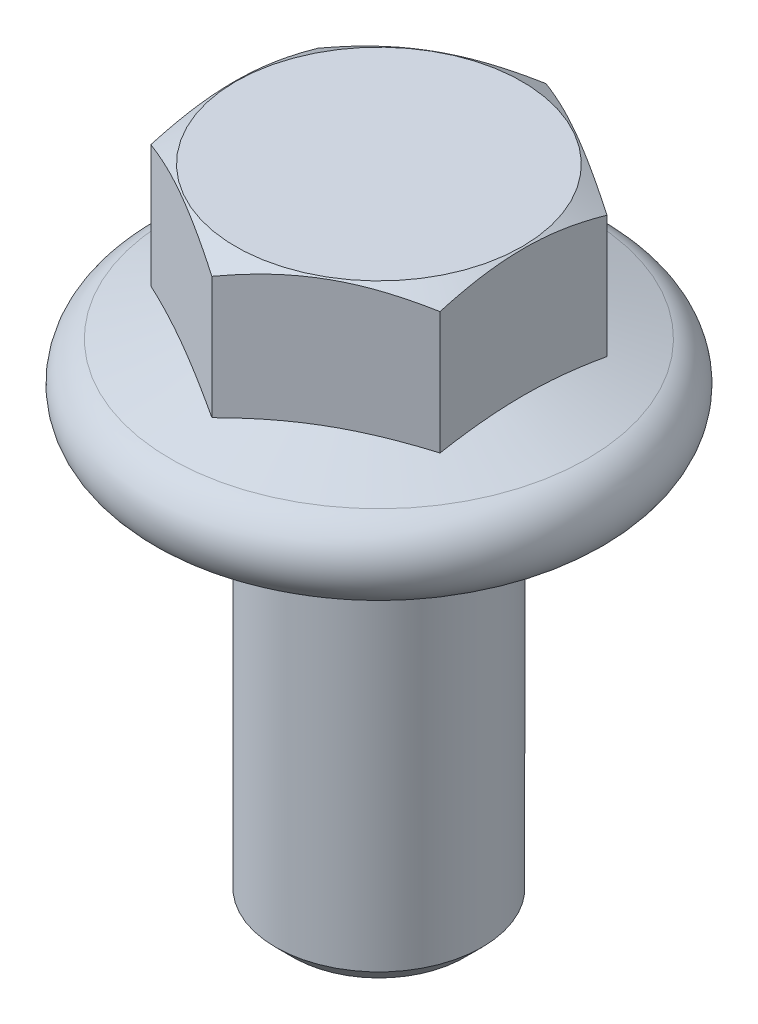
ISO-10303-21;
HEADER;
FILE_DESCRIPTION(('STEP AP214'),'2;1');
FILE_NAME('part.step','',(''),(''),'','','');
FILE_SCHEMA(('AUTOMOTIVE_DESIGN { 1 0 10303 214 1 1 1 1 }'));
ENDSEC;
DATA;
#1=APPLICATION_CONTEXT('core data for automotive mechanical design processes');
#2=APPLICATION_PROTOCOL_DEFINITION('international standard','automotive_design',2000,#1);
#3=PRODUCT_CONTEXT('',#1,'mechanical');
#4=PRODUCT('Part','Part','',(#3));
#5=PRODUCT_RELATED_PRODUCT_CATEGORY('part','',(#4));
#6=PRODUCT_DEFINITION_FORMATION('','',#4);
#7=PRODUCT_DEFINITION_CONTEXT('part definition',#1,'design');
#8=PRODUCT_DEFINITION('design','',#6,#7);
#9=PRODUCT_DEFINITION_SHAPE('','',#8);
#10=(LENGTH_UNIT() NAMED_UNIT(*) SI_UNIT(.MILLI.,.METRE.));
#11=(NAMED_UNIT(*) PLANE_ANGLE_UNIT() SI_UNIT($,.RADIAN.));
#12=(NAMED_UNIT(*) SI_UNIT($,.STERADIAN.) SOLID_ANGLE_UNIT());
#13=UNCERTAINTY_MEASURE_WITH_UNIT(LENGTH_MEASURE(1.E-05),#10,'distance_accuracy_value','');
#14=(GEOMETRIC_REPRESENTATION_CONTEXT(3) GLOBAL_UNCERTAINTY_ASSIGNED_CONTEXT((#13)) GLOBAL_UNIT_ASSIGNED_CONTEXT((#10,
#11,#12)) REPRESENTATION_CONTEXT('',''));
#15=CARTESIAN_POINT('',(0.,0.,0.));
#16=DIRECTION('',(0.,0.,1.));
#17=DIRECTION('',(1.,0.,0.));
#18=AXIS2_PLACEMENT_3D('',#15,#16,#17);
#19=CARTESIAN_POINT('',(170.6193906262,302.387780121987,22.6340859965214));
#20=DIRECTION('',(-0.5,0.,0.866025403784439));
#21=DIRECTION('',(-0.866025403784439,0.,-0.5));
#22=AXIS2_PLACEMENT_3D('',#19,#20,#21);
#23=PLANE('',#22);
#24=CARTESIAN_POINT('',(172.3693906262,301.3916498064,23.6444489676032));
#25=CARTESIAN_POINT('',(172.224447909406,301.42211784189,23.5607662510451));
#26=CARTESIAN_POINT('',(172.079027263864,301.449833689514,23.4768076021957));
#27=CARTESIAN_POINT('',(171.78724052237,301.498595308074,23.308344448448));
#28=CARTESIAN_POINT('',(171.640873777568,301.519635860691,23.2238395689367));
#29=CARTESIAN_POINT('',(171.348819013108,301.55366830598,23.0552216720571));
#30=CARTESIAN_POINT('',(171.203137661927,301.5667344217,22.9711125047369));
#31=CARTESIAN_POINT('',(170.911434317047,301.584259743163,22.8026975000469));
#32=CARTESIAN_POINT('',(170.765412471623,301.588722175582,22.7183917482842));
#33=CARTESIAN_POINT('',(170.473368780777,301.588722175582,22.5497802447587));
#34=CARTESIAN_POINT('',(170.327346935353,301.584259743163,22.4654744929959));
#35=CARTESIAN_POINT('',(170.035643590473,301.5667344217,22.2970594883059));
#36=CARTESIAN_POINT('',(169.889962239292,301.55366830598,22.2129503209857));
#37=CARTESIAN_POINT('',(169.597907474831,301.519635860691,22.0443324241061));
#38=CARTESIAN_POINT('',(169.45154073003,301.498595308074,21.9598275445948));
#39=CARTESIAN_POINT('',(169.159753988536,301.449833689514,21.7913643908471));
#40=CARTESIAN_POINT('',(169.014333342994,301.42211784189,21.7074057419977));
#41=CARTESIAN_POINT('',(168.8693906262,301.3916498064,21.6237230254396));
#42=B_SPLINE_CURVE_WITH_KNOTS('',3,(#24,#25,#26,#27,#28,#29,#30,#31,#32,#33,#34,#35,#36,#37,#38,
#39,#40,#41),.UNSPECIFIED.,.F.,.F.,(4,2,2,2,2,2,2,2,4),(0.,0.5104009483192,1.02119991788174,
1.52716902069209,2.03294833077718,2.53872764086228,3.04469674367263,3.5554957132352,
4.06589666155435),.UNSPECIFIED.);
#43=CARTESIAN_POINT('',(172.3693906262,301.3916498064,23.6444489676033));
#44=VERTEX_POINT('',#43);
#45=CARTESIAN_POINT('',(168.8693906262,301.3916498064,21.6237230254396));
#46=VERTEX_POINT('',#45);
#47=EDGE_CURVE('E41',#44,#46,#42,.T.);
#48=ORIENTED_EDGE('',*,*,#47,.F.);
#49=DIRECTION('',(0.,1.,0.));
#50=VECTOR('',#49,1.);
#51=CARTESIAN_POINT('',(172.3693906262,300.087780121987,23.6444489676033));
#52=LINE('',#51,#50);
#53=CARTESIAN_POINT('',(172.3693906262,304.354965471396,23.6444489676032));
#54=VERTEX_POINT('',#53);
#55=EDGE_CURVE('E11',#44,#54,#52,.T.);
#56=ORIENTED_EDGE('',*,*,#55,.T.);
#57=CARTESIAN_POINT('',(172.3693906262,304.354965471396,23.6444489676032));
#58=CARTESIAN_POINT('',(172.215586822965,304.406248267424,23.5556503004029));
#59=CARTESIAN_POINT('',(172.060455387488,304.45288728647,23.4660851243706));
#60=CARTESIAN_POINT('',(171.747506519499,304.534294293445,23.2854040111948));
#61=CARTESIAN_POINT('',(171.589683528302,304.569033485804,23.1942848647427));
#62=CARTESIAN_POINT('',(171.275993367122,304.62310754324,23.0131757657433));
#63=CARTESIAN_POINT('',(171.120174448871,304.642802343101,22.9232136713464));
#64=CARTESIAN_POINT('',(170.807803815391,304.666309427168,22.74286640202));
#65=CARTESIAN_POINT('',(170.651253234766,304.670141181941,22.6524818821539));
#66=CARTESIAN_POINT('',(170.358755269208,304.662149463625,22.4836081030017));
#67=CARTESIAN_POINT('',(170.222763992573,304.652288222267,22.4050935028293));
#68=CARTESIAN_POINT('',(169.951667378112,304.621040195139,22.2485757994935));
#69=CARTESIAN_POINT('',(169.816562977236,304.599642745551,22.1705732372791));
#70=CARTESIAN_POINT('',(169.544907878182,304.546153263054,22.0137330927137));
#71=CARTESIAN_POINT('',(169.408391544279,304.513834597514,21.9349153505858));
#72=CARTESIAN_POINT('',(169.137394428691,304.440484889927,21.7784550929519));
#73=CARTESIAN_POINT('',(169.002910177899,304.399471071079,21.7008105745553));
#74=CARTESIAN_POINT('',(168.8693906262,304.354965471396,21.6237230254397));
#75=B_SPLINE_CURVE_WITH_KNOTS('',3,(#57,#58,#59,#60,#61,#62,#63,#64,#65,#66,#67,#68,#69,#70,#71,
#72,#73,#74),.UNSPECIFIED.,.F.,.F.,(4,2,2,2,2,2,2,2,4),(0.,0.554778020224442,1.11088917979741,
1.65323831076759,2.19492155557116,2.66648861960575,3.1384923391401,3.62096283935506,
4.10248645365099),.UNSPECIFIED.);
#76=CARTESIAN_POINT('',(168.8693906262,304.354965471396,21.6237230254397));
#77=VERTEX_POINT('',#76);
#78=EDGE_CURVE('E33',#54,#77,#75,.T.);
#79=ORIENTED_EDGE('',*,*,#78,.T.);
#80=DIRECTION('',(0.,1.,0.));
#81=VECTOR('',#80,1.);
#82=CARTESIAN_POINT('',(168.8693906262,300.087780121987,21.6237230254396));
#83=LINE('',#82,#81);
#84=EDGE_CURVE('E148',#46,#77,#83,.T.);
#85=ORIENTED_EDGE('',*,*,#84,.F.);
#86=EDGE_LOOP('',(#48,#56,#79,#85));
#87=FACE_BOUND('',#86,.T.);
#88=ADVANCED_FACE('F17',(#87),#23,.T.);
#89=CARTESIAN_POINT('',(168.8693906262,302.387780121987,19.6029970832759));
#90=DIRECTION('',(-1.,0.,0.));
#91=DIRECTION('',(0.,0.,-1.));
#92=AXIS2_PLACEMENT_3D('',#89,#90,#91);
#93=PLANE('',#92);
#94=CARTESIAN_POINT('',(168.8693906262,301.3916498064,21.6237230254396));
#95=CARTESIAN_POINT('',(168.8693906262,301.42211784189,21.4563575923233));
#96=CARTESIAN_POINT('',(168.8693906262,301.449833689514,21.2884402946245));
#97=CARTESIAN_POINT('',(168.8693906262,301.498595308074,20.9515139871291));
#98=CARTESIAN_POINT('',(168.8693906262,301.519635860691,20.7825042281065));
#99=CARTESIAN_POINT('',(168.8693906262,301.55366830598,20.4452684343473));
#100=CARTESIAN_POINT('',(168.8693906262,301.5667344217,20.2770500997069));
#101=CARTESIAN_POINT('',(168.8693906262,301.584259743163,19.9402200903269));
#102=CARTESIAN_POINT('',(168.8693906262,301.588722175582,19.7716085868014));
#103=CARTESIAN_POINT('',(168.8693906262,301.588722175582,19.4343855797504));
#104=CARTESIAN_POINT('',(168.8693906262,301.584259743163,19.2657740762249));
#105=CARTESIAN_POINT('',(168.8693906262,301.5667344217,18.928944066845));
#106=CARTESIAN_POINT('',(168.8693906262,301.55366830598,18.7607257322046));
#107=CARTESIAN_POINT('',(168.8693906262,301.519635860691,18.4234899384454));
#108=CARTESIAN_POINT('',(168.8693906262,301.498595308074,18.2544801794228));
#109=CARTESIAN_POINT('',(168.8693906262,301.449833689514,17.9175538719273));
#110=CARTESIAN_POINT('',(168.8693906262,301.42211784189,17.7496365742286));
#111=CARTESIAN_POINT('',(168.8693906262,301.3916498064,17.5822711411123));
#112=B_SPLINE_CURVE_WITH_KNOTS('',3,(#94,#95,#96,#97,#98,#99,#100,#101,#102,#103,#104,#105,#106,
#107,#108,#109,#110,#111),.UNSPECIFIED.,.F.,.F.,(4,2,2,2,2,2,2,2,4),(0.,0.510400948319158,
1.02119991788171,1.52716902069204,2.03294833077716,2.53872764086229,3.04469674367262,
3.55549571323517,4.06589666155433),.UNSPECIFIED.);
#113=CARTESIAN_POINT('',(168.8693906262,301.3916498064,17.5822711411122));
#114=VERTEX_POINT('',#113);
#115=EDGE_CURVE('E255',#46,#114,#112,.T.);
#116=ORIENTED_EDGE('',*,*,#115,.F.);
#117=ORIENTED_EDGE('',*,*,#84,.T.);
#118=CARTESIAN_POINT('',(168.8693906262,304.354965471395,21.6237230254398));
#119=CARTESIAN_POINT('',(168.8693906262,304.406248267424,21.4461256910392));
#120=CARTESIAN_POINT('',(168.8693906262,304.45288728647,21.2669953389746));
#121=CARTESIAN_POINT('',(168.8693906262,304.534294293445,20.905633112623));
#122=CARTESIAN_POINT('',(168.8693906262,304.569033485804,20.7233948197187));
#123=CARTESIAN_POINT('',(168.8693906262,304.62310754324,20.3611766217199));
#124=CARTESIAN_POINT('',(168.8693906262,304.642802343101,20.1812524329262));
#125=CARTESIAN_POINT('',(168.8693906262,304.666309427168,19.8205578942732));
#126=CARTESIAN_POINT('',(168.8693906262,304.670141181941,19.6397888545411));
#127=CARTESIAN_POINT('',(168.8693906262,304.662149463625,19.3020412962367));
#128=CARTESIAN_POINT('',(168.8693906262,304.652288222267,19.1450120958918));
#129=CARTESIAN_POINT('',(168.8693906262,304.621040195139,18.8319766892202));
#130=CARTESIAN_POINT('',(168.8693906262,304.599642745551,18.6759715647914));
#131=CARTESIAN_POINT('',(168.8693906262,304.546153263054,18.3622912756605));
#132=CARTESIAN_POINT('',(168.8693906262,304.513834597514,18.2046557914049));
#133=CARTESIAN_POINT('',(168.8693906262,304.440484889927,17.8917352761369));
#134=CARTESIAN_POINT('',(168.8693906262,304.399471071079,17.7364462393436));
#135=CARTESIAN_POINT('',(168.8693906262,304.354965471396,17.5822711411123));
#136=B_SPLINE_CURVE_WITH_KNOTS('',3,(#118,#119,#120,#121,#122,#123,#124,#125,#126,#127,#128,
#129,#130,#131,#132,#133,#134,#135),.UNSPECIFIED.,.F.,.F.,(4,2,2,2,2,2,2,2,4),(0.,
0.554778020224522,1.11088917979753,1.65323831076773,2.19492155557132,2.66648861960593,
3.13849233914033,3.6209628393553,4.10248645365131),.UNSPECIFIED.);
#137=CARTESIAN_POINT('',(168.8693906262,304.354965471396,17.5822711411123));
#138=VERTEX_POINT('',#137);
#139=EDGE_CURVE('E150',#77,#138,#136,.T.);
#140=ORIENTED_EDGE('',*,*,#139,.T.);
#141=DIRECTION('',(0.,1.,0.));
#142=VECTOR('',#141,1.);
#143=CARTESIAN_POINT('',(168.8693906262,300.087780121987,17.5822711411122));
#144=LINE('',#143,#142);
#145=EDGE_CURVE('E159',#114,#138,#144,.T.);
#146=ORIENTED_EDGE('',*,*,#145,.F.);
#147=EDGE_LOOP('',(#116,#117,#140,#146));
#148=FACE_BOUND('',#147,.T.);
#149=ADVANCED_FACE('F260',(#148),#93,.T.);
#150=CARTESIAN_POINT('',(170.6193906262,302.387780121987,16.5719081700304));
#151=DIRECTION('',(-0.5,0.,-0.866025403784439));
#152=DIRECTION('',(0.866025403784439,0.,-0.5));
#153=AXIS2_PLACEMENT_3D('',#150,#151,#152);
#154=PLANE('',#153);
#155=CARTESIAN_POINT('',(168.8693906262,301.3916498064,17.5822711411123));
#156=CARTESIAN_POINT('',(169.014333342994,301.42211784189,17.4985884245541));
#157=CARTESIAN_POINT('',(169.159753988536,301.449833689514,17.4146297757047));
#158=CARTESIAN_POINT('',(169.45154073003,301.498595308074,17.246166621957));
#159=CARTESIAN_POINT('',(169.597907474831,301.519635860691,17.1616617424457));
#160=CARTESIAN_POINT('',(169.889962239292,301.55366830598,16.9930438455661));
#161=CARTESIAN_POINT('',(170.035643590473,301.5667344217,16.9089346782459));
#162=CARTESIAN_POINT('',(170.327346935353,301.584259743163,16.7405196735559));
#163=CARTESIAN_POINT('',(170.473368780777,301.588722175582,16.6562139217932));
#164=CARTESIAN_POINT('',(170.765412471623,301.588722175582,16.4876024182677));
#165=CARTESIAN_POINT('',(170.911434317047,301.584259743163,16.4032966665049));
#166=CARTESIAN_POINT('',(171.203137661927,301.5667344217,16.2348816618149));
#167=CARTESIAN_POINT('',(171.348819013108,301.55366830598,16.1507724944947));
#168=CARTESIAN_POINT('',(171.640873777568,301.519635860691,15.9821545976151));
#169=CARTESIAN_POINT('',(171.78724052237,301.498595308074,15.8976497181038));
#170=CARTESIAN_POINT('',(172.079027263864,301.449833689514,15.7291865643561));
#171=CARTESIAN_POINT('',(172.224447909406,301.42211784189,15.6452279155067));
#172=CARTESIAN_POINT('',(172.3693906262,301.3916498064,15.5615451989486));
#173=B_SPLINE_CURVE_WITH_KNOTS('',3,(#155,#156,#157,#158,#159,#160,#161,#162,#163,#164,#165,
#166,#167,#168,#169,#170,#171,#172),.UNSPECIFIED.,.F.,.F.,(4,2,2,2,2,2,2,2,4),(0.,
0.5104009483192,1.02119991788174,1.52716902069209,2.03294833077718,2.53872764086228,
3.04469674367263,3.55549571323517,4.06589666155434),.UNSPECIFIED.);
#174=CARTESIAN_POINT('',(172.3693906262,301.3916498064,15.5615451989486));
#175=VERTEX_POINT('',#174);
#176=EDGE_CURVE('E228',#114,#175,#173,.T.);
#177=ORIENTED_EDGE('',*,*,#176,.F.);
#178=ORIENTED_EDGE('',*,*,#145,.T.);
#179=CARTESIAN_POINT('',(168.8693906262,304.354965471396,17.5822711411122));
#180=CARTESIAN_POINT('',(169.023194429435,304.406248267424,17.4934724739119));
#181=CARTESIAN_POINT('',(169.178325864912,304.45288728647,17.4039072978796));
#182=CARTESIAN_POINT('',(169.491274732901,304.534294293445,17.2232261847038));
#183=CARTESIAN_POINT('',(169.649097724098,304.569033485804,17.1321070382517));
#184=CARTESIAN_POINT('',(169.962787885278,304.62310754324,16.9509979392523));
#185=CARTESIAN_POINT('',(170.118606803529,304.642802343101,16.8610358448554));
#186=CARTESIAN_POINT('',(170.430977437009,304.666309427168,16.680688575529));
#187=CARTESIAN_POINT('',(170.587528017634,304.670141181941,16.5903040556629));
#188=CARTESIAN_POINT('',(170.880025983192,304.662149463625,16.4214302765107));
#189=CARTESIAN_POINT('',(171.016017259827,304.652288222267,16.3429156763382));
#190=CARTESIAN_POINT('',(171.287113874288,304.621040195139,16.1863979730025));
#191=CARTESIAN_POINT('',(171.422218275164,304.599642745551,16.108395410788));
#192=CARTESIAN_POINT('',(171.693873374218,304.546153263054,15.9515552662226));
#193=CARTESIAN_POINT('',(171.830389708121,304.513834597514,15.8727375240948));
#194=CARTESIAN_POINT('',(172.101386823709,304.440484889927,15.7162772664609));
#195=CARTESIAN_POINT('',(172.235871074501,304.399471071079,15.6386327480642));
#196=CARTESIAN_POINT('',(172.3693906262,304.354965471396,15.5615451989486));
#197=B_SPLINE_CURVE_WITH_KNOTS('',3,(#179,#180,#181,#182,#183,#184,#185,#186,#187,#188,#189,
#190,#191,#192,#193,#194,#195,#196),.UNSPECIFIED.,.F.,.F.,(4,2,2,2,2,2,2,2,4),(0.,
0.554778020224465,1.11088917979744,1.65323831076765,2.19492155557118,2.66648861960576,
3.13849233914014,3.62096283935509,4.10248645365103),.UNSPECIFIED.);
#198=CARTESIAN_POINT('',(172.3693906262,304.354965471396,15.5615451989486));
#199=VERTEX_POINT('',#198);
#200=EDGE_CURVE('E158',#138,#199,#197,.T.);
#201=ORIENTED_EDGE('',*,*,#200,.T.);
#202=DIRECTION('',(0.,1.,0.));
#203=VECTOR('',#202,1.);
#204=CARTESIAN_POINT('',(172.3693906262,300.087780121987,15.5615451989486));
#205=LINE('',#204,#203);
#206=EDGE_CURVE('E156',#175,#199,#205,.T.);
#207=ORIENTED_EDGE('',*,*,#206,.F.);
#208=EDGE_LOOP('',(#177,#178,#201,#207));
#209=FACE_BOUND('',#208,.T.);
#210=ADVANCED_FACE('F219',(#209),#154,.T.);
#211=CARTESIAN_POINT('',(174.1193906262,302.387780121987,16.5719081700304));
#212=DIRECTION('',(0.5,0.,-0.866025403784439));
#213=DIRECTION('',(0.866025403784439,0.,0.5));
#214=AXIS2_PLACEMENT_3D('',#211,#212,#213);
#215=PLANE('',#214);
#216=CARTESIAN_POINT('',(172.3693906262,301.3916498064,15.5615451989486));
#217=CARTESIAN_POINT('',(172.514333342994,301.42211784189,15.6452279155068));
#218=CARTESIAN_POINT('',(172.659753988536,301.449833689514,15.7291865643561));
#219=CARTESIAN_POINT('',(172.95154073003,301.498595308074,15.8976497181038));
#220=CARTESIAN_POINT('',(173.097907474832,301.519635860691,15.9821545976151));
#221=CARTESIAN_POINT('',(173.389962239292,301.55366830598,16.1507724944947));
#222=CARTESIAN_POINT('',(173.535643590473,301.5667344217,16.2348816618149));
#223=CARTESIAN_POINT('',(173.827346935353,301.584259743163,16.4032966665049));
#224=CARTESIAN_POINT('',(173.973368780777,301.588722175582,16.4876024182676));
#225=CARTESIAN_POINT('',(174.265412471623,301.588722175582,16.6562139217932));
#226=CARTESIAN_POINT('',(174.411434317047,301.584259743163,16.7405196735559));
#227=CARTESIAN_POINT('',(174.703137661927,301.5667344217,16.9089346782459));
#228=CARTESIAN_POINT('',(174.848819013108,301.55366830598,16.9930438455661));
#229=CARTESIAN_POINT('',(175.140873777568,301.519635860691,17.1616617424457));
#230=CARTESIAN_POINT('',(175.28724052237,301.498595308074,17.246166621957));
#231=CARTESIAN_POINT('',(175.579027263864,301.449833689514,17.4146297757047));
#232=CARTESIAN_POINT('',(175.724447909406,301.42211784189,17.4985884245541));
#233=CARTESIAN_POINT('',(175.8693906262,301.3916498064,17.5822711411123));
#234=B_SPLINE_CURVE_WITH_KNOTS('',3,(#216,#217,#218,#219,#220,#221,#222,#223,#224,#225,#226,
#227,#228,#229,#230,#231,#232,#233),.UNSPECIFIED.,.F.,.F.,(4,2,2,2,2,2,2,2,4),(0.,
0.510400948319148,1.02119991788172,1.52716902069204,2.03294833077716,2.53872764086225,
3.0446967436726,3.55549571323517,4.06589666155434),.UNSPECIFIED.);
#235=CARTESIAN_POINT('',(175.8693906262,301.3916498064,17.5822711411122));
#236=VERTEX_POINT('',#235);
#237=EDGE_CURVE('E64',#175,#236,#234,.T.);
#238=ORIENTED_EDGE('',*,*,#237,.F.);
#239=ORIENTED_EDGE('',*,*,#206,.T.);
#240=CARTESIAN_POINT('',(172.3693906262,304.354965471396,15.5615451989486));
#241=CARTESIAN_POINT('',(172.523194429435,304.406248267424,15.6503438661489));
#242=CARTESIAN_POINT('',(172.678325864912,304.45288728647,15.7399090421812));
#243=CARTESIAN_POINT('',(172.991274732901,304.534294293445,15.920590155357));
#244=CARTESIAN_POINT('',(173.149097724098,304.569033485804,16.0117093018091));
#245=CARTESIAN_POINT('',(173.462787885278,304.62310754324,16.1928184008085));
#246=CARTESIAN_POINT('',(173.618606803529,304.642802343101,16.2827804952054));
#247=CARTESIAN_POINT('',(173.930977437009,304.666309427168,16.4631277645319));
#248=CARTESIAN_POINT('',(174.087528017634,304.670141181941,16.553512284398));
#249=CARTESIAN_POINT('',(174.380025983192,304.662149463625,16.7223860635501));
#250=CARTESIAN_POINT('',(174.516017259827,304.652288222267,16.8009006637226));
#251=CARTESIAN_POINT('',(174.787113874288,304.621040195139,16.9574183670583));
#252=CARTESIAN_POINT('',(174.922218275164,304.599642745551,17.0354209292727));
#253=CARTESIAN_POINT('',(175.193873374218,304.546153263054,17.1922610738382));
#254=CARTESIAN_POINT('',(175.330389708121,304.513834597514,17.271078815966));
#255=CARTESIAN_POINT('',(175.601386823709,304.440484889927,17.4275390735999));
#256=CARTESIAN_POINT('',(175.735871074501,304.399471071079,17.5051835919966));
#257=CARTESIAN_POINT('',(175.8693906262,304.354965471396,17.5822711411122));
#258=B_SPLINE_CURVE_WITH_KNOTS('',3,(#240,#241,#242,#243,#244,#245,#246,#247,#248,#249,#250,
#251,#252,#253,#254,#255,#256,#257),.UNSPECIFIED.,.F.,.F.,(4,2,2,2,2,2,2,2,4),(0.,
0.554778020224465,1.11088917979744,1.65323831076761,2.19492155557121,2.66648861960579,
3.13849233914013,3.62096283935506,4.10248645365103),.UNSPECIFIED.);
#259=CARTESIAN_POINT('',(175.8693906262,304.354965471396,17.5822711411122));
#260=VERTEX_POINT('',#259);
#261=EDGE_CURVE('E155',#199,#260,#258,.T.);
#262=ORIENTED_EDGE('',*,*,#261,.T.);
#263=DIRECTION('',(0.,1.,0.));
#264=VECTOR('',#263,1.);
#265=CARTESIAN_POINT('',(175.8693906262,300.087780121987,17.5822711411122));
#266=LINE('',#265,#264);
#267=EDGE_CURVE('E153',#236,#260,#266,.T.);
#268=ORIENTED_EDGE('',*,*,#267,.F.);
#269=EDGE_LOOP('',(#238,#239,#262,#268));
#270=FACE_BOUND('',#269,.T.);
#271=ADVANCED_FACE('F214',(#270),#215,.T.);
#272=CARTESIAN_POINT('',(175.8693906262,302.387780121987,19.6029970832759));
#273=DIRECTION('',(1.,0.,0.));
#274=DIRECTION('',(0.,0.,1.));
#275=AXIS2_PLACEMENT_3D('',#272,#273,#274);
#276=PLANE('',#275);
#277=CARTESIAN_POINT('',(175.8693906262,301.3916498064,17.5822711411122));
#278=CARTESIAN_POINT('',(175.8693906262,301.42211784189,17.7496365742285));
#279=CARTESIAN_POINT('',(175.8693906262,301.449833689514,17.9175538719273));
#280=CARTESIAN_POINT('',(175.8693906262,301.498595308074,18.2544801794228));
#281=CARTESIAN_POINT('',(175.8693906262,301.519635860691,18.4234899384453));
#282=CARTESIAN_POINT('',(175.8693906262,301.55366830598,18.7607257322045));
#283=CARTESIAN_POINT('',(175.8693906262,301.5667344217,18.9289440668449));
#284=CARTESIAN_POINT('',(175.8693906262,301.584259743163,19.2657740762249));
#285=CARTESIAN_POINT('',(175.8693906262,301.588722175582,19.4343855797504));
#286=CARTESIAN_POINT('',(175.8693906262,301.588722175582,19.7716085868014));
#287=CARTESIAN_POINT('',(175.8693906262,301.584259743163,19.9402200903269));
#288=CARTESIAN_POINT('',(175.8693906262,301.5667344217,20.2770500997069));
#289=CARTESIAN_POINT('',(175.8693906262,301.55366830598,20.4452684343473));
#290=CARTESIAN_POINT('',(175.8693906262,301.519635860691,20.7825042281065));
#291=CARTESIAN_POINT('',(175.8693906262,301.498595308074,20.951513987129));
#292=CARTESIAN_POINT('',(175.8693906262,301.449833689514,21.2884402946245));
#293=CARTESIAN_POINT('',(175.8693906262,301.42211784189,21.4563575923233));
#294=CARTESIAN_POINT('',(175.8693906262,301.3916498064,21.6237230254396));
#295=B_SPLINE_CURVE_WITH_KNOTS('',3,(#277,#278,#279,#280,#281,#282,#283,#284,#285,#286,#287,
#288,#289,#290,#291,#292,#293,#294),.UNSPECIFIED.,.F.,.F.,(4,2,2,2,2,2,2,2,4),(0.,
0.510400948319165,1.02119991788172,1.52716902069205,2.03294833077719,2.53872764086232,
3.04469674367266,3.55549571323521,4.06589666155438),.UNSPECIFIED.);
#296=CARTESIAN_POINT('',(175.8693906262,301.3916498064,21.6237230254396));
#297=VERTEX_POINT('',#296);
#298=EDGE_CURVE('E21',#236,#297,#295,.T.);
#299=ORIENTED_EDGE('',*,*,#298,.F.);
#300=ORIENTED_EDGE('',*,*,#267,.T.);
#301=CARTESIAN_POINT('',(175.8693906262,304.354965471396,17.5822711411123));
#302=CARTESIAN_POINT('',(175.8693906262,304.406248267424,17.7598684755129));
#303=CARTESIAN_POINT('',(175.8693906262,304.45288728647,17.9389988275775));
#304=CARTESIAN_POINT('',(175.8693906262,304.534294293445,18.3003610539291));
#305=CARTESIAN_POINT('',(175.8693906262,304.569033485804,18.4825993468334));
#306=CARTESIAN_POINT('',(175.8693906262,304.62310754324,18.8448175448321));
#307=CARTESIAN_POINT('',(175.8693906262,304.642802343101,19.0247417336259));
#308=CARTESIAN_POINT('',(175.8693906262,304.666309427168,19.3854362722788));
#309=CARTESIAN_POINT('',(175.8693906262,304.670141181941,19.5662053120109));
#310=CARTESIAN_POINT('',(175.8693906262,304.662149463625,19.9039528703153));
#311=CARTESIAN_POINT('',(175.8693906262,304.652288222267,20.0609820706602));
#312=CARTESIAN_POINT('',(175.8693906262,304.621040195139,20.3740174773317));
#313=CARTESIAN_POINT('',(175.8693906262,304.599642745551,20.5300226017606));
#314=CARTESIAN_POINT('',(175.8693906262,304.546153263054,20.8437028908914));
#315=CARTESIAN_POINT('',(175.8693906262,304.513834597514,21.001338375147));
#316=CARTESIAN_POINT('',(175.8693906262,304.440484889927,21.3142588904149));
#317=CARTESIAN_POINT('',(175.8693906262,304.399471071079,21.4695479272082));
#318=CARTESIAN_POINT('',(175.8693906262,304.354965471396,21.6237230254395));
#319=B_SPLINE_CURVE_WITH_KNOTS('',3,(#301,#302,#303,#304,#305,#306,#307,#308,#309,#310,#311,
#312,#313,#314,#315,#316,#317,#318),.UNSPECIFIED.,.F.,.F.,(4,2,2,2,2,2,2,2,4),(0.,
0.554778020224448,1.1108891797974,1.65323831076756,2.1949215555711,2.66648861960567,
3.13849233914003,3.62096283935496,4.10248645365089),.UNSPECIFIED.);
#320=CARTESIAN_POINT('',(175.8693906262,304.354965471396,21.6237230254395));
#321=VERTEX_POINT('',#320);
#322=EDGE_CURVE('E152',#260,#321,#319,.T.);
#323=ORIENTED_EDGE('',*,*,#322,.T.);
#324=DIRECTION('',(0.,1.,0.));
#325=VECTOR('',#324,1.);
#326=CARTESIAN_POINT('',(175.8693906262,300.087780121987,21.6237230254396));
#327=LINE('',#326,#325);
#328=EDGE_CURVE('E73',#297,#321,#327,.T.);
#329=ORIENTED_EDGE('',*,*,#328,.F.);
#330=EDGE_LOOP('',(#299,#300,#323,#329));
#331=FACE_BOUND('',#330,.T.);
#332=ADVANCED_FACE('F211',(#331),#276,.T.);
#333=CARTESIAN_POINT('',(174.1193906262,302.387780121987,22.6340859965214));
#334=DIRECTION('',(0.5,0.,0.866025403784439));
#335=DIRECTION('',(-0.866025403784439,0.,0.5));
#336=AXIS2_PLACEMENT_3D('',#333,#334,#335);
#337=PLANE('',#336);
#338=CARTESIAN_POINT('',(175.8693906262,301.3916498064,21.6237230254396));
#339=CARTESIAN_POINT('',(175.724447909406,301.42211784189,21.7074057419977));
#340=CARTESIAN_POINT('',(175.579027263864,301.449833689514,21.7913643908471));
#341=CARTESIAN_POINT('',(175.28724052237,301.498595308074,21.9598275445948));
#342=CARTESIAN_POINT('',(175.140873777568,301.519635860691,22.0443324241061));
#343=CARTESIAN_POINT('',(174.848819013108,301.55366830598,22.2129503209857));
#344=CARTESIAN_POINT('',(174.703137661927,301.5667344217,22.2970594883059));
#345=CARTESIAN_POINT('',(174.411434317047,301.584259743163,22.4654744929959));
#346=CARTESIAN_POINT('',(174.265412471623,301.588722175582,22.5497802447587));
#347=CARTESIAN_POINT('',(173.973368780777,301.588722175582,22.7183917482842));
#348=CARTESIAN_POINT('',(173.827346935353,301.584259743163,22.8026975000469));
#349=CARTESIAN_POINT('',(173.535643590473,301.5667344217,22.9711125047369));
#350=CARTESIAN_POINT('',(173.389962239292,301.55366830598,23.0552216720571));
#351=CARTESIAN_POINT('',(173.097907474832,301.519635860691,23.2238395689367));
#352=CARTESIAN_POINT('',(172.95154073003,301.498595308074,23.308344448448));
#353=CARTESIAN_POINT('',(172.659753988536,301.449833689514,23.4768076021957));
#354=CARTESIAN_POINT('',(172.514333342994,301.42211784189,23.5607662510451));
#355=CARTESIAN_POINT('',(172.3693906262,301.3916498064,23.6444489676032));
#356=B_SPLINE_CURVE_WITH_KNOTS('',3,(#338,#339,#340,#341,#342,#343,#344,#345,#346,#347,#348,
#349,#350,#351,#352,#353,#354,#355),.UNSPECIFIED.,.F.,.F.,(4,2,2,2,2,2,2,2,4),(0.,
0.510400948319148,1.02119991788172,1.52716902069207,2.03294833077716,2.53872764086225,
3.0446967436726,3.55549571323514,4.06589666155434),.UNSPECIFIED.);
#357=EDGE_CURVE('E121',#297,#44,#356,.T.);
#358=ORIENTED_EDGE('',*,*,#357,.F.);
#359=ORIENTED_EDGE('',*,*,#328,.T.);
#360=CARTESIAN_POINT('',(175.8693906262,304.354965471396,21.6237230254396));
#361=CARTESIAN_POINT('',(175.715586822965,304.406248267424,21.7125216926399));
#362=CARTESIAN_POINT('',(175.560455387488,304.45288728647,21.8020868686722));
#363=CARTESIAN_POINT('',(175.247506519499,304.534294293445,21.982767981848));
#364=CARTESIAN_POINT('',(175.089683528302,304.569033485804,22.0738871283001));
#365=CARTESIAN_POINT('',(174.775993367122,304.62310754324,22.2549962272995));
#366=CARTESIAN_POINT('',(174.620174448871,304.642802343101,22.3449583216964));
#367=CARTESIAN_POINT('',(174.307803815391,304.666309427168,22.5253055910228));
#368=CARTESIAN_POINT('',(174.151253234766,304.670141181941,22.6156901108889));
#369=CARTESIAN_POINT('',(173.858755269208,304.662149463625,22.7845638900411));
#370=CARTESIAN_POINT('',(173.722763992573,304.652288222267,22.8630784902135));
#371=CARTESIAN_POINT('',(173.451667378112,304.621040195139,23.0195961935493));
#372=CARTESIAN_POINT('',(173.316562977236,304.599642745551,23.0975987557637));
#373=CARTESIAN_POINT('',(173.044907878182,304.546153263054,23.2544389003291));
#374=CARTESIAN_POINT('',(172.908391544279,304.513834597514,23.333256642457));
#375=CARTESIAN_POINT('',(172.637394428691,304.440484889927,23.4897169000909));
#376=CARTESIAN_POINT('',(172.502910177899,304.399471071079,23.5673614184876));
#377=CARTESIAN_POINT('',(172.3693906262,304.354965471396,23.6444489676032));
#378=B_SPLINE_CURVE_WITH_KNOTS('',3,(#360,#361,#362,#363,#364,#365,#366,#367,#368,#369,#370,
#371,#372,#373,#374,#375,#376,#377),.UNSPECIFIED.,.F.,.F.,(4,2,2,2,2,2,2,2,4),(0.,
0.554778020224465,1.11088917979744,1.65323831076758,2.19492155557116,2.66648861960575,
3.13849233914013,3.62096283935509,4.10248645365103),.UNSPECIFIED.);
#379=EDGE_CURVE('E116',#321,#54,#378,.T.);
#380=ORIENTED_EDGE('',*,*,#379,.T.);
#381=ORIENTED_EDGE('',*,*,#55,.F.);
#382=EDGE_LOOP('',(#358,#359,#380,#381));
#383=FACE_BOUND('',#382,.T.);
#384=ADVANCED_FACE('F181',(#383),#337,.T.);
#385=CARTESIAN_POINT('',(172.3693906262,306.688298804729,19.6029970832759));
#386=DIRECTION('',(0.,-1.,0.));
#387=DIRECTION('',(1.,0.,0.));
#388=AXIS2_PLACEMENT_3D('',#385,#386,#387);
#389=CONICAL_SURFACE('',#388,0.,1.0471975511966);
#390=ORIENTED_EDGE('',*,*,#78,.F.);
#391=ORIENTED_EDGE('',*,*,#379,.F.);
#392=ORIENTED_EDGE('',*,*,#322,.F.);
#393=ORIENTED_EDGE('',*,*,#261,.F.);
#394=ORIENTED_EDGE('',*,*,#200,.F.);
#395=ORIENTED_EDGE('',*,*,#139,.F.);
#396=EDGE_LOOP('',(#390,#391,#392,#393,#394,#395));
#397=FACE_BOUND('',#396,.T.);
#398=CARTESIAN_POINT('',(172.3693906262,304.687780121987,19.6029970832759));
#399=DIRECTION('',(0.,1.,0.));
#400=DIRECTION('',(1.,0.,0.));
#401=AXIS2_PLACEMENT_3D('',#398,#399,#400);
#402=CIRCLE('',#401,3.465);
#403=CARTESIAN_POINT('',(175.8343906262,304.687780121987,19.6029970832759));
#404=VERTEX_POINT('',#403);
#405=EDGE_CURVE('E113',#404,#404,#402,.T.);
#406=ORIENTED_EDGE('',*,*,#405,.F.);
#407=EDGE_LOOP('',(#406));
#408=FACE_BOUND('',#407,.T.);
#409=ADVANCED_FACE('F114',(#397,#408),#389,.T.);
#410=CARTESIAN_POINT('',(172.3693906262,304.687780121987,19.6029970832759));
#411=DIRECTION('',(0.,1.,0.));
#412=DIRECTION('',(-1.,0.,0.));
#413=AXIS2_PLACEMENT_3D('',#410,#411,#412);
#414=PLANE('',#413);
#415=ORIENTED_EDGE('',*,*,#405,.T.);
#416=EDGE_LOOP('',(#415));
#417=FACE_BOUND('',#416,.T.);
#418=ADVANCED_FACE('F180',(#417),#414,.T.);
#419=CARTESIAN_POINT('',(172.3693906262,299.087780121987,19.6029970832759));
#420=DIRECTION('',(0.,-1.,0.));
#421=DIRECTION('',(1.,0.,0.));
#422=AXIS2_PLACEMENT_3D('',#419,#420,#421);
#423=PLANE('',#422);
#424=CARTESIAN_POINT('',(172.3693906262,299.087780121987,19.6029970832759));
#425=DIRECTION('',(0.,-1.,0.));
#426=DIRECTION('',(-1.,0.,0.));
#427=AXIS2_PLACEMENT_3D('',#424,#425,#426);
#428=CIRCLE('',#427,3.05551918177834);
#429=CARTESIAN_POINT('',(169.313871444422,299.087780121987,19.6029970832759));
#430=VERTEX_POINT('',#429);
#431=EDGE_CURVE('E124',#430,#430,#428,.T.);
#432=ORIENTED_EDGE('',*,*,#431,.F.);
#433=EDGE_LOOP('',(#432));
#434=FACE_BOUND('',#433,.T.);
#435=CARTESIAN_POINT('',(172.3693906262,299.087780121987,19.6029970832759));
#436=DIRECTION('',(0.,-1.,0.));
#437=DIRECTION('',(-1.,0.,0.));
#438=AXIS2_PLACEMENT_3D('',#435,#436,#437);
#439=CIRCLE('',#438,4.7);
#440=CARTESIAN_POINT('',(167.6693906262,299.087780121987,19.6029970832759));
#441=VERTEX_POINT('',#440);
#442=EDGE_CURVE('E117',#441,#441,#439,.T.);
#443=ORIENTED_EDGE('',*,*,#442,.T.);
#444=EDGE_LOOP('',(#443));
#445=FACE_BOUND('',#444,.T.);
#446=ADVANCED_FACE('F239',(#434,#445),#423,.T.);
#447=CARTESIAN_POINT('',(172.3693906262,301.887780121987,19.6029970832759));
#448=DIRECTION('',(0.,-1.,0.));
#449=DIRECTION('',(1.,0.,0.));
#450=AXIS2_PLACEMENT_3D('',#447,#448,#449);
#451=CONICAL_SURFACE('',#450,2.67834504514476,1.22173047639603);
#452=ORIENTED_EDGE('',*,*,#357,.T.);
#453=ORIENTED_EDGE('',*,*,#47,.T.);
#454=ORIENTED_EDGE('',*,*,#115,.T.);
#455=ORIENTED_EDGE('',*,*,#176,.T.);
#456=ORIENTED_EDGE('',*,*,#237,.T.);
#457=ORIENTED_EDGE('',*,*,#298,.T.);
#458=EDGE_LOOP('',(#452,#453,#454,#455,#456,#457));
#459=FACE_BOUND('',#458,.T.);
#460=CARTESIAN_POINT('',(172.3693906262,301.027472742773,19.6029970832759));
#461=DIRECTION('',(0.,1.,0.));
#462=DIRECTION('',(1.,0.,0.));
#463=AXIS2_PLACEMENT_3D('',#460,#461,#462);
#464=CIRCLE('',#463,5.04202014332566);
#465=CARTESIAN_POINT('',(177.411410769526,301.027472742773,19.6029970832759));
#466=VERTEX_POINT('',#465);
#467=EDGE_CURVE('E129',#466,#466,#464,.T.);
#468=ORIENTED_EDGE('',*,*,#467,.T.);
#469=EDGE_LOOP('',(#468));
#470=FACE_BOUND('',#469,.T.);
#471=ADVANCED_FACE('F234',(#459,#470),#451,.T.);
#472=CARTESIAN_POINT('',(172.3693906262,300.087780121987,19.6029970832759));
#473=DIRECTION('',(0.,-1.,0.));
#474=DIRECTION('',(1.,0.,0.));
#475=AXIS2_PLACEMENT_3D('',#472,#473,#474);
#476=TOROIDAL_SURFACE('',#475,4.7,1.);
#477=ORIENTED_EDGE('',*,*,#442,.F.);
#478=EDGE_LOOP('',(#477));
#479=FACE_BOUND('',#478,.T.);
#480=ORIENTED_EDGE('',*,*,#467,.F.);
#481=EDGE_LOOP('',(#480));
#482=FACE_BOUND('',#481,.T.);
#483=ADVANCED_FACE('F238',(#479,#482),#476,.T.);
#484=CARTESIAN_POINT('',(172.3693906262,299.137780121987,19.6029970832759));
#485=DIRECTION('',(0.,-1.,0.));
#486=DIRECTION('',(1.,0.,0.));
#487=AXIS2_PLACEMENT_3D('',#484,#485,#486);
#488=TOROIDAL_SURFACE('',#487,2.86187001446222,0.1);
#489=CARTESIAN_POINT('',(172.3693906262,299.157242005846,19.6029970832759));
#490=DIRECTION('',(0.,1.,0.));
#491=DIRECTION('',(-1.,0.,0.));
#492=AXIS2_PLACEMENT_3D('',#489,#490,#491);
#493=CIRCLE('',#492,2.76378211981328);
#494=CARTESIAN_POINT('',(169.605608506387,299.157242005846,19.6029970832759));
#495=VERTEX_POINT('',#494);
#496=EDGE_CURVE('E126',#495,#495,#493,.T.);
#497=ORIENTED_EDGE('',*,*,#496,.T.);
#498=EDGE_LOOP('',(#497));
#499=FACE_BOUND('',#498,.T.);
#500=CARTESIAN_POINT('',(172.3693906262,299.162780121988,19.6029970832759));
#501=DIRECTION('',(0.,1.,0.));
#502=DIRECTION('',(-1.,0.,0.));
#503=AXIS2_PLACEMENT_3D('',#500,#501,#502);
#504=CIRCLE('',#503,2.95869459812297);
#505=CARTESIAN_POINT('',(169.410696028077,299.162780121988,19.6029970832759));
#506=VERTEX_POINT('',#505);
#507=EDGE_CURVE('E127',#506,#506,#504,.T.);
#508=ORIENTED_EDGE('',*,*,#507,.F.);
#509=EDGE_LOOP('',(#508));
#510=FACE_BOUND('',#509,.T.);
#511=ADVANCED_FACE('F318',(#499,#510),#488,.F.);
#512=CARTESIAN_POINT('',(172.3693906262,299.187780121987,19.6029970832759));
#513=DIRECTION('',(0.,-1.,0.));
#514=DIRECTION('',(1.,0.,0.));
#515=AXIS2_PLACEMENT_3D('',#512,#513,#514);
#516=TOROIDAL_SURFACE('',#515,3.05551918177834,0.1);
#517=ORIENTED_EDGE('',*,*,#431,.T.);
#518=EDGE_LOOP('',(#517));
#519=FACE_BOUND('',#518,.T.);
#520=ORIENTED_EDGE('',*,*,#507,.T.);
#521=EDGE_LOOP('',(#520));
#522=FACE_BOUND('',#521,.T.);
#523=ADVANCED_FACE('F325',(#519,#522),#516,.T.);
#524=CARTESIAN_POINT('',(172.3693906262,289.087780121987,19.6029970832759));
#525=DIRECTION('',(0.,-1.,0.));
#526=DIRECTION('',(1.,0.,0.));
#527=AXIS2_PLACEMENT_3D('',#524,#525,#526);
#528=PLANE('',#527);
#529=CARTESIAN_POINT('',(172.3693906262,289.087780121987,19.6029970832759));
#530=DIRECTION('',(0.,-1.,0.));
#531=DIRECTION('',(-1.,0.,0.));
#532=AXIS2_PLACEMENT_3D('',#529,#530,#531);
#533=CIRCLE('',#532,2.0669872984);
#534=CARTESIAN_POINT('',(170.3024033278,289.087780121987,19.6029970832759));
#535=VERTEX_POINT('',#534);
#536=EDGE_CURVE('E136',#535,#535,#533,.T.);
#537=ORIENTED_EDGE('',*,*,#536,.T.);
#538=EDGE_LOOP('',(#537));
#539=FACE_BOUND('',#538,.T.);
#540=ADVANCED_FACE('F332',(#539),#528,.T.);
#541=CARTESIAN_POINT('',(172.3693906262,297.827780121987,19.6029970832759));
#542=DIRECTION('',(0.,-1.,0.));
#543=DIRECTION('',(1.,0.,0.));
#544=AXIS2_PLACEMENT_3D('',#541,#542,#543);
#545=CYLINDRICAL_SURFACE('',#544,2.5);
#546=CARTESIAN_POINT('',(172.3693906262,289.520792823587,19.6029970832759));
#547=DIRECTION('',(0.,1.,0.));
#548=DIRECTION('',(-1.,0.,0.));
#549=AXIS2_PLACEMENT_3D('',#546,#547,#548);
#550=CIRCLE('',#549,2.5);
#551=CARTESIAN_POINT('',(169.8693906262,289.520792823587,19.6029970832759));
#552=VERTEX_POINT('',#551);
#553=EDGE_CURVE('E139',#552,#552,#550,.T.);
#554=ORIENTED_EDGE('',*,*,#553,.T.);
#555=EDGE_LOOP('',(#554));
#556=FACE_BOUND('',#555,.T.);
#557=CARTESIAN_POINT('',(172.3693906262,297.5330339353,19.6029970832759));
#558=DIRECTION('',(0.,-1.,0.));
#559=DIRECTION('',(1.,0.,0.));
#560=AXIS2_PLACEMENT_3D('',#557,#558,#559);
#561=CIRCLE('',#560,2.5);
#562=CARTESIAN_POINT('',(174.8693906262,297.5330339353,19.6029970832759));
#563=VERTEX_POINT('',#562);
#564=EDGE_CURVE('E142',#563,#563,#561,.T.);
#565=ORIENTED_EDGE('',*,*,#564,.T.);
#566=EDGE_LOOP('',(#565));
#567=FACE_BOUND('',#566,.T.);
#568=ADVANCED_FACE('F340',(#556,#567),#545,.T.);
#569=CARTESIAN_POINT('',(172.3693906262,297.827780121987,19.6029970832759));
#570=DIRECTION('',(0.,1.,0.));
#571=DIRECTION('',(-1.,0.,0.));
#572=AXIS2_PLACEMENT_3D('',#569,#570,#571);
#573=CONICAL_SURFACE('',#572,2.5,0.195868843478818);
#574=CARTESIAN_POINT('',(172.3693906262,298.116890451067,19.6029970832759));
#575=DIRECTION('',(0.,1.,0.));
#576=DIRECTION('',(1.,0.,0.));
#577=AXIS2_PLACEMENT_3D('',#574,#575,#576);
#578=CIRCLE('',#577,2.55736316053173);
#579=CARTESIAN_POINT('',(174.926753786732,298.116890451067,19.6029970832759));
#580=VERTEX_POINT('',#579);
#581=EDGE_CURVE('E145',#580,#580,#578,.T.);
#582=ORIENTED_EDGE('',*,*,#581,.T.);
#583=EDGE_LOOP('',(#582));
#584=FACE_BOUND('',#583,.T.);
#585=ORIENTED_EDGE('',*,*,#496,.F.);
#586=EDGE_LOOP('',(#585));
#587=FACE_BOUND('',#586,.T.);
#588=ADVANCED_FACE('F348',(#584,#587),#573,.T.);
#589=CARTESIAN_POINT('',(172.3693906262,297.5330339353,19.6029970832759));
#590=DIRECTION('',(0.,1.,0.));
#591=DIRECTION('',(-1.,0.,0.));
#592=AXIS2_PLACEMENT_3D('',#589,#590,#591);
#593=TOROIDAL_SURFACE('',#592,5.5,3.);
#594=ORIENTED_EDGE('',*,*,#564,.F.);
#595=EDGE_LOOP('',(#594));
#596=FACE_BOUND('',#595,.T.);
#597=ORIENTED_EDGE('',*,*,#581,.F.);
#598=EDGE_LOOP('',(#597));
#599=FACE_BOUND('',#598,.T.);
#600=ADVANCED_FACE('F356',(#596,#599),#593,.F.);
#601=CARTESIAN_POINT('',(172.3693906262,289.520792823587,19.6029970832759));
#602=DIRECTION('',(0.,1.,0.));
#603=DIRECTION('',(-1.,0.,0.));
#604=AXIS2_PLACEMENT_3D('',#601,#602,#603);
#605=CONICAL_SURFACE('',#604,2.5,0.785398163397448);
#606=ORIENTED_EDGE('',*,*,#536,.F.);
#607=EDGE_LOOP('',(#606));
#608=FACE_BOUND('',#607,.T.);
#609=ORIENTED_EDGE('',*,*,#553,.F.);
#610=EDGE_LOOP('',(#609));
#611=FACE_BOUND('',#610,.T.);
#612=ADVANCED_FACE('F19',(#608,#611),#605,.T.);
#613=CLOSED_SHELL('',(#88,#149,#210,#271,#332,#384,#409,#418,#446,#471,#483,#511,#523,#540,#568,
#588,#600,#612));
#614=MANIFOLD_SOLID_BREP('B1',#613);
#615=ADVANCED_BREP_SHAPE_REPRESENTATION('',(#18,#614),#14);
#616=SHAPE_DEFINITION_REPRESENTATION(#9,#615);
ENDSEC;
END-ISO-10303-21;
